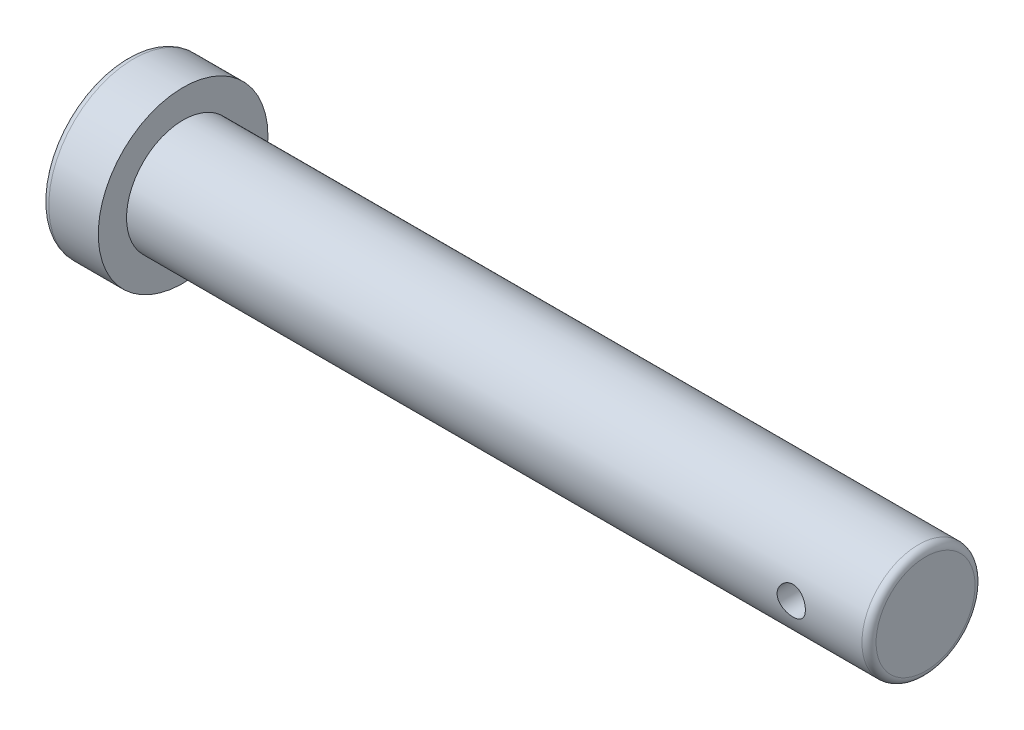
ISO-10303-21;
HEADER;
FILE_DESCRIPTION(('STEP AP214'),'2;1');
FILE_NAME('part.step','',(''),(''),'','','');
FILE_SCHEMA(('AUTOMOTIVE_DESIGN { 1 0 10303 214 1 1 1 1 }'));
ENDSEC;
DATA;
#1=APPLICATION_CONTEXT('core data for automotive mechanical design processes');
#2=APPLICATION_PROTOCOL_DEFINITION('international standard','automotive_design',2000,#1);
#3=PRODUCT_CONTEXT('',#1,'mechanical');
#4=PRODUCT('Part','Part','',(#3));
#5=PRODUCT_RELATED_PRODUCT_CATEGORY('part','',(#4));
#6=PRODUCT_DEFINITION_FORMATION('','',#4);
#7=PRODUCT_DEFINITION_CONTEXT('part definition',#1,'design');
#8=PRODUCT_DEFINITION('design','',#6,#7);
#9=PRODUCT_DEFINITION_SHAPE('','',#8);
#10=(LENGTH_UNIT() NAMED_UNIT(*) SI_UNIT(.MILLI.,.METRE.));
#11=(NAMED_UNIT(*) PLANE_ANGLE_UNIT() SI_UNIT($,.RADIAN.));
#12=(NAMED_UNIT(*) SI_UNIT($,.STERADIAN.) SOLID_ANGLE_UNIT());
#13=UNCERTAINTY_MEASURE_WITH_UNIT(LENGTH_MEASURE(1.E-05),#10,'distance_accuracy_value','');
#14=(GEOMETRIC_REPRESENTATION_CONTEXT(3) GLOBAL_UNCERTAINTY_ASSIGNED_CONTEXT((#13)) GLOBAL_UNIT_ASSIGNED_CONTEXT((#10,
#11,#12)) REPRESENTATION_CONTEXT('',''));
#15=CARTESIAN_POINT('',(0.,0.,0.));
#16=DIRECTION('',(0.,0.,1.));
#17=DIRECTION('',(1.,0.,0.));
#18=AXIS2_PLACEMENT_3D('',#15,#16,#17);
#19=CARTESIAN_POINT('',(4.,0.,0.));
#20=DIRECTION('',(-1.,0.,0.));
#21=DIRECTION('',(0.,0.,1.));
#22=AXIS2_PLACEMENT_3D('',#19,#20,#21);
#23=CYLINDRICAL_SURFACE('',#22,12.);
#24=CARTESIAN_POINT('',(-3.,0.,0.));
#25=DIRECTION('',(1.,0.,0.));
#26=DIRECTION('',(0.,0.,-1.));
#27=AXIS2_PLACEMENT_3D('',#24,#25,#26);
#28=CIRCLE('',#27,12.);
#29=CARTESIAN_POINT('',(-3.,0.,-12.));
#30=VERTEX_POINT('',#29);
#31=EDGE_CURVE('E93',#30,#30,#28,.T.);
#32=ORIENTED_EDGE('',*,*,#31,.T.);
#33=EDGE_LOOP('',(#32));
#34=FACE_BOUND('',#33,.T.);
#35=CARTESIAN_POINT('',(4.,0.,0.));
#36=DIRECTION('',(1.,0.,0.));
#37=DIRECTION('',(0.,0.,-1.));
#38=AXIS2_PLACEMENT_3D('',#35,#36,#37);
#39=CIRCLE('',#38,12.);
#40=CARTESIAN_POINT('',(4.,0.,-12.));
#41=VERTEX_POINT('',#40);
#42=EDGE_CURVE('E97',#41,#41,#39,.T.);
#43=ORIENTED_EDGE('',*,*,#42,.F.);
#44=EDGE_LOOP('',(#43));
#45=FACE_BOUND('',#44,.T.);
#46=ADVANCED_FACE('F30',(#34,#45),#23,.T.);
#47=CARTESIAN_POINT('',(4.,0.,0.));
#48=DIRECTION('',(1.,0.,0.));
#49=DIRECTION('',(0.,0.,-1.));
#50=AXIS2_PLACEMENT_3D('',#47,#48,#49);
#51=PLANE('',#50);
#52=CARTESIAN_POINT('',(4.,0.,0.));
#53=DIRECTION('',(1.,0.,0.));
#54=DIRECTION('',(0.,0.,-1.));
#55=AXIS2_PLACEMENT_3D('',#52,#53,#54);
#56=CIRCLE('',#55,8.);
#57=CARTESIAN_POINT('',(4.,0.,-8.));
#58=VERTEX_POINT('',#57);
#59=EDGE_CURVE('E94',#58,#58,#56,.T.);
#60=ORIENTED_EDGE('',*,*,#59,.F.);
#61=EDGE_LOOP('',(#60));
#62=FACE_BOUND('',#61,.T.);
#63=ORIENTED_EDGE('',*,*,#42,.T.);
#64=EDGE_LOOP('',(#63));
#65=FACE_BOUND('',#64,.T.);
#66=ADVANCED_FACE('F77',(#62,#65),#51,.T.);
#67=CARTESIAN_POINT('',(-4.,0.,0.));
#68=DIRECTION('',(1.,0.,0.));
#69=DIRECTION('',(0.,0.,-1.));
#70=AXIS2_PLACEMENT_3D('',#67,#68,#69);
#71=PLANE('',#70);
#72=CARTESIAN_POINT('',(-4.,0.,0.));
#73=DIRECTION('',(1.,0.,0.));
#74=DIRECTION('',(0.,0.,-1.));
#75=AXIS2_PLACEMENT_3D('',#72,#73,#74);
#76=CIRCLE('',#75,11.);
#77=CARTESIAN_POINT('',(-4.,0.,-11.));
#78=VERTEX_POINT('',#77);
#79=EDGE_CURVE('E48',#78,#78,#76,.F.);
#80=ORIENTED_EDGE('',*,*,#79,.T.);
#81=EDGE_LOOP('',(#80));
#82=FACE_BOUND('',#81,.T.);
#83=ADVANCED_FACE('F74',(#82),#71,.F.);
#84=CARTESIAN_POINT('',(109.,0.,0.));
#85=DIRECTION('',(-1.,0.,0.));
#86=DIRECTION('',(0.,0.,1.));
#87=AXIS2_PLACEMENT_3D('',#84,#85,#86);
#88=CYLINDRICAL_SURFACE('',#87,8.);
#89=CARTESIAN_POINT('',(100.,0.,8.));
#90=CARTESIAN_POINT('',(99.9999968990158,-0.110501451559641,7.9999981315735));
#91=CARTESIAN_POINT('',(99.990811265635,-0.22103754377435,7.99768770842435));
#92=CARTESIAN_POINT('',(99.954366464924,-0.438941765027376,7.98869485106526));
#93=CARTESIAN_POINT('',(99.9270970539495,-0.546308062494318,7.98200993893301));
#94=CARTESIAN_POINT('',(99.8554143287172,-0.754694496243434,7.96500835109376));
#95=CARTESIAN_POINT('',(99.811021601713,-0.855722084573335,7.95469603789411));
#96=CARTESIAN_POINT('',(99.7064248132735,-1.04889617587257,7.93153791743495));
#97=CARTESIAN_POINT('',(99.646220218508,-1.14104237913168,7.91869202472208));
#98=CARTESIAN_POINT('',(99.5103989471278,-1.31573590306788,7.89156551455591));
#99=CARTESIAN_POINT('',(99.4345179000546,-1.39807425341474,7.87726276197502));
#100=CARTESIAN_POINT('',(99.270063726788,-1.54899856960442,7.84898160157249));
#101=CARTESIAN_POINT('',(99.1814891694041,-1.61758298259892,7.83500323053157));
#102=CARTESIAN_POINT('',(98.992539697684,-1.74003539039863,7.80873034264225));
#103=CARTESIAN_POINT('',(98.8920090255884,-1.79366962123352,7.79646392619748));
#104=CARTESIAN_POINT('',(98.6830021177866,-1.88319587806765,7.77532659757355));
#105=CARTESIAN_POINT('',(98.5745271555573,-1.91909074058685,7.76645514259225));
#106=CARTESIAN_POINT('',(98.3550086690644,-1.97140644907302,7.7533396892843));
#107=CARTESIAN_POINT('',(98.244060138616,-1.98820302444273,7.74900654662681));
#108=CARTESIAN_POINT('',(98.0208419080009,-2.00301570008854,7.74519149946122));
#109=CARTESIAN_POINT('',(97.9085724257438,-2.00103485575748,7.74570880570571));
#110=CARTESIAN_POINT('',(97.6887789230062,-1.9786486995196,7.75145607355756));
#111=CARTESIAN_POINT('',(97.5812058380462,-1.95869112025417,7.75657150676392));
#112=CARTESIAN_POINT('',(97.3709852654519,-1.90163224920398,7.77075612894759));
#113=CARTESIAN_POINT('',(97.2683381292948,-1.86452973609252,7.77982559958985));
#114=CARTESIAN_POINT('',(97.0696826449972,-1.77385263724958,7.80100151874212));
#115=CARTESIAN_POINT('',(96.9737517709472,-1.72011555631056,7.81313769959755));
#116=CARTESIAN_POINT('',(96.7921083869909,-1.59780836801993,7.83906281127988));
#117=CARTESIAN_POINT('',(96.7063976692437,-1.52923566507845,7.85285203112837));
#118=CARTESIAN_POINT('',(96.5450618457408,-1.37688456624162,7.88101174053189));
#119=CARTESIAN_POINT('',(96.4697940132515,-1.29272834422114,7.89538759304001));
#120=CARTESIAN_POINT('',(96.3343716767148,-1.11281589000493,7.92274620771675));
#121=CARTESIAN_POINT('',(96.2742176343152,-1.01705930361059,7.93572892732543));
#122=CARTESIAN_POINT('',(96.1705992183675,-0.816154518241855,7.95890309458921));
#123=CARTESIAN_POINT('',(96.1271928796608,-0.710975190944831,7.96908480170303));
#124=CARTESIAN_POINT('',(96.0587769257206,-0.494501344190513,7.98543889321888));
#125=CARTESIAN_POINT('',(96.0337637914425,-0.383207998867318,7.99161204452374));
#126=CARTESIAN_POINT('',(96.0033899125882,-0.160719960520042,7.999139990285));
#127=CARTESIAN_POINT('',(95.9975426318996,-0.049595626650952,8.00061404677705));
#128=CARTESIAN_POINT('',(96.0043320027407,0.172043833068673,7.99891739752601));
#129=CARTESIAN_POINT('',(96.0169669903989,0.282559012859456,7.99574710989128));
#130=CARTESIAN_POINT('',(96.0599612111885,0.498152358368652,7.98519441503143));
#131=CARTESIAN_POINT('',(96.0900550179693,0.603286825291669,7.97787512247748));
#132=CARTESIAN_POINT('',(96.1668094453713,0.807009723270011,7.95984942178845));
#133=CARTESIAN_POINT('',(96.2134717390842,0.905597492043508,7.94914267159856));
#134=CARTESIAN_POINT('',(96.3229815051663,1.09536417923979,7.92524410568414));
#135=CARTESIAN_POINT('',(96.3861014831957,1.18638058911443,7.91201156489243));
#136=CARTESIAN_POINT('',(96.5263865450626,1.35670215152432,7.88459345583226));
#137=CARTESIAN_POINT('',(96.6035540528225,1.43600527863067,7.87040772335606));
#138=CARTESIAN_POINT('',(96.7720026144593,1.58265409076364,7.84225275947695));
#139=CARTESIAN_POINT('',(96.8635836040032,1.6496584901627,7.82829738916375));
#140=CARTESIAN_POINT('',(97.0569768459543,1.76734767868359,7.80257171169652));
#141=CARTESIAN_POINT('',(97.1587886439463,1.81803319221058,7.79080130756035));
#142=CARTESIAN_POINT('',(97.3692076298841,1.90126856081239,7.77090792979553));
#143=CARTESIAN_POINT('',(97.4777701711253,1.93392586220541,7.76276340389208));
#144=CARTESIAN_POINT('',(97.6990795171855,1.98046087993836,7.75102325453578));
#145=CARTESIAN_POINT('',(97.8118254013767,1.99434270330487,7.74742663626582));
#146=CARTESIAN_POINT('',(98.0348280318069,2.00271812044532,7.74526534938609));
#147=CARTESIAN_POINT('',(98.145063246833,1.99775719704016,7.74655910304351));
#148=CARTESIAN_POINT('',(98.3630718515573,1.96983637108382,7.7537054534379));
#149=CARTESIAN_POINT('',(98.4708452906848,1.94687683024902,7.75955795855809));
#150=CARTESIAN_POINT('',(98.6802779454205,1.88390842592372,7.77508347576963));
#151=CARTESIAN_POINT('',(98.7819697403203,1.84400187290717,7.78473353648413));
#152=CARTESIAN_POINT('',(98.9772871769516,1.74835321814009,7.80677007633105));
#153=CARTESIAN_POINT('',(99.0709116975826,1.69260892004559,7.81915693494364));
#154=CARTESIAN_POINT('',(99.2500728386694,1.56515699818285,7.84567512351349));
#155=CARTESIAN_POINT('',(99.3353347645653,1.49307088388301,7.85984353109009));
#156=CARTESIAN_POINT('',(99.4927293930605,1.33571916158631,7.88810702995048));
#157=CARTESIAN_POINT('',(99.564858973484,1.25045042834819,7.90220210302746));
#158=CARTESIAN_POINT('',(99.6952150780862,1.06729011560345,7.92903540863551));
#159=CARTESIAN_POINT('',(99.7531661515621,0.969197896421844,7.94174444487824));
#160=CARTESIAN_POINT('',(99.8516632839207,0.764354746013966,7.96406566633491));
#161=CARTESIAN_POINT('',(99.8922218141981,0.657610084582318,7.97368006933042));
#162=CARTESIAN_POINT('',(99.9487624404395,0.459213670991294,7.98730746087389));
#163=CARTESIAN_POINT('',(99.9679349907379,0.36850689454409,7.9920344673692));
#164=CARTESIAN_POINT('',(99.9935545914959,0.18520809538171,7.99838140309264));
#165=CARTESIAN_POINT('',(100.000002599074,0.0926162149901548,8.00000156601192));
#166=CARTESIAN_POINT('',(100.,0.,8.));
#167=B_SPLINE_CURVE_WITH_KNOTS('',3,(#89,#90,#91,#92,#93,#94,#95,#96,#97,#98,#99,#100,#101,#102,
#103,#104,#105,#106,#107,#108,#109,#110,#111,#112,#113,#114,#115,#116,#117,#118,#119,#120,#121,
#122,#123,#124,#125,#126,#127,#128,#129,#130,#131,#132,#133,#134,#135,#136,#137,#138,#139,#140,
#141,#142,#143,#144,#145,#146,#147,#148,#149,#150,#151,#152,#153,#154,#155,#156,#157,#158,#159,
#160,#161,#162,#163,#164,#165,#166),.UNSPECIFIED.,.T.,.F.,(4,2,2,2,2,2,2,2,2,2,2,2,2,2,2,2,2,2,
2,2,2,2,2,2,2,2,2,2,2,2,2,2,2,2,2,2,2,2,4),(0.,0.331164949962519,0.662517650351865,
0.993473203048145,1.32443992022576,1.66152580582852,1.99864972773415,2.34078196727743,
2.68285948225823,3.01808393468094,3.3532538415469,3.68029996013785,4.00736937959145,
4.33774037169599,4.66816921119311,5.00802001296453,5.34788119415423,5.68890972016578,
6.0298729825595,6.36211078603461,6.6943186815475,7.02160366023142,7.3489216976748,
7.68204783424895,8.01523150681784,8.35659345610394,8.69794025003769,9.03723006156474,
9.37644564340969,9.70591707202575,10.035381879458,10.3628853408369,10.6904342418696,
11.0265276855097,11.3627009303165,11.7049624733721,12.0469781843289,12.3245632392729,
12.6021274139514),.UNSPECIFIED.);
#168=CARTESIAN_POINT('',(100.,0.,8.));
#169=VERTEX_POINT('',#168);
#170=EDGE_CURVE('E34',#169,#169,#167,.T.);
#171=ORIENTED_EDGE('',*,*,#170,.T.);
#172=EDGE_LOOP('',(#171));
#173=FACE_BOUND('',#172,.T.);
#174=CARTESIAN_POINT('',(100.,0.,-8.));
#175=CARTESIAN_POINT('',(99.9999968990158,0.110501451559641,-7.9999981315735));
#176=CARTESIAN_POINT('',(99.990811265635,0.22103754377435,-7.99768770842435));
#177=CARTESIAN_POINT('',(99.954366464924,0.438941765027376,-7.98869485106526));
#178=CARTESIAN_POINT('',(99.9270970539495,0.546308062494318,-7.98200993893301));
#179=CARTESIAN_POINT('',(99.8554143287172,0.754694496243434,-7.96500835109376));
#180=CARTESIAN_POINT('',(99.811021601713,0.855722084573335,-7.95469603789411));
#181=CARTESIAN_POINT('',(99.7064248132735,1.04889617587257,-7.93153791743495));
#182=CARTESIAN_POINT('',(99.646220218508,1.14104237913168,-7.91869202472208));
#183=CARTESIAN_POINT('',(99.5103989471278,1.31573590306788,-7.89156551455591));
#184=CARTESIAN_POINT('',(99.4345179000546,1.39807425341474,-7.87726276197502));
#185=CARTESIAN_POINT('',(99.270063726788,1.54899856960442,-7.84898160157249));
#186=CARTESIAN_POINT('',(99.1814891694041,1.61758298259892,-7.83500323053157));
#187=CARTESIAN_POINT('',(98.992539697684,1.74003539039863,-7.80873034264225));
#188=CARTESIAN_POINT('',(98.8920090255884,1.79366962123352,-7.79646392619748));
#189=CARTESIAN_POINT('',(98.6830021177866,1.88319587806765,-7.77532659757355));
#190=CARTESIAN_POINT('',(98.5745271555573,1.91909074058685,-7.76645514259225));
#191=CARTESIAN_POINT('',(98.3550086690644,1.97140644907302,-7.7533396892843));
#192=CARTESIAN_POINT('',(98.244060138616,1.98820302444273,-7.74900654662681));
#193=CARTESIAN_POINT('',(98.0208419080009,2.00301570008854,-7.74519149946122));
#194=CARTESIAN_POINT('',(97.9085724257438,2.00103485575748,-7.74570880570571));
#195=CARTESIAN_POINT('',(97.6887789230062,1.9786486995196,-7.75145607355756));
#196=CARTESIAN_POINT('',(97.5812058380462,1.95869112025417,-7.75657150676392));
#197=CARTESIAN_POINT('',(97.3709852654519,1.90163224920398,-7.77075612894759));
#198=CARTESIAN_POINT('',(97.2683381292948,1.86452973609252,-7.77982559958985));
#199=CARTESIAN_POINT('',(97.0696826449972,1.77385263724958,-7.80100151874212));
#200=CARTESIAN_POINT('',(96.9737517709472,1.72011555631056,-7.81313769959755));
#201=CARTESIAN_POINT('',(96.7921083869909,1.59780836801993,-7.83906281127988));
#202=CARTESIAN_POINT('',(96.7063976692437,1.52923566507845,-7.85285203112837));
#203=CARTESIAN_POINT('',(96.5450618457408,1.37688456624162,-7.88101174053189));
#204=CARTESIAN_POINT('',(96.4697940132515,1.29272834422114,-7.89538759304001));
#205=CARTESIAN_POINT('',(96.3343716767148,1.11281589000493,-7.92274620771675));
#206=CARTESIAN_POINT('',(96.2742176343152,1.01705930361059,-7.93572892732543));
#207=CARTESIAN_POINT('',(96.1705992183675,0.816154518241855,-7.95890309458921));
#208=CARTESIAN_POINT('',(96.1271928796608,0.710975190944831,-7.96908480170303));
#209=CARTESIAN_POINT('',(96.0587769257206,0.494501344190513,-7.98543889321888));
#210=CARTESIAN_POINT('',(96.0337637914425,0.383207998867318,-7.99161204452374));
#211=CARTESIAN_POINT('',(96.0033899125882,0.160719960520042,-7.999139990285));
#212=CARTESIAN_POINT('',(95.9975426318996,0.049595626650952,-8.00061404677705));
#213=CARTESIAN_POINT('',(96.0043320027407,-0.172043833068673,-7.99891739752601));
#214=CARTESIAN_POINT('',(96.0169669903989,-0.282559012859456,-7.99574710989128));
#215=CARTESIAN_POINT('',(96.0599612111885,-0.498152358368652,-7.98519441503143));
#216=CARTESIAN_POINT('',(96.0900550179693,-0.603286825291669,-7.97787512247748));
#217=CARTESIAN_POINT('',(96.1668094453713,-0.807009723270011,-7.95984942178845));
#218=CARTESIAN_POINT('',(96.2134717390842,-0.905597492043508,-7.94914267159856));
#219=CARTESIAN_POINT('',(96.3229815051663,-1.09536417923979,-7.92524410568414));
#220=CARTESIAN_POINT('',(96.3861014831957,-1.18638058911443,-7.91201156489243));
#221=CARTESIAN_POINT('',(96.5263865450626,-1.35670215152432,-7.88459345583226));
#222=CARTESIAN_POINT('',(96.6035540528225,-1.43600527863067,-7.87040772335606));
#223=CARTESIAN_POINT('',(96.7720026144593,-1.58265409076364,-7.84225275947695));
#224=CARTESIAN_POINT('',(96.8635836040032,-1.6496584901627,-7.82829738916375));
#225=CARTESIAN_POINT('',(97.0569768459543,-1.76734767868359,-7.80257171169652));
#226=CARTESIAN_POINT('',(97.1587886439463,-1.81803319221058,-7.79080130756035));
#227=CARTESIAN_POINT('',(97.3692076298841,-1.90126856081239,-7.77090792979553));
#228=CARTESIAN_POINT('',(97.4777701711253,-1.93392586220541,-7.76276340389208));
#229=CARTESIAN_POINT('',(97.6990795171855,-1.98046087993836,-7.75102325453578));
#230=CARTESIAN_POINT('',(97.8118254013767,-1.99434270330487,-7.74742663626582));
#231=CARTESIAN_POINT('',(98.0348280318069,-2.00271812044532,-7.74526534938609));
#232=CARTESIAN_POINT('',(98.145063246833,-1.99775719704016,-7.74655910304351));
#233=CARTESIAN_POINT('',(98.3630718515573,-1.96983637108382,-7.7537054534379));
#234=CARTESIAN_POINT('',(98.4708452906848,-1.94687683024902,-7.75955795855809));
#235=CARTESIAN_POINT('',(98.6802779454205,-1.88390842592372,-7.77508347576963));
#236=CARTESIAN_POINT('',(98.7819697403203,-1.84400187290717,-7.78473353648413));
#237=CARTESIAN_POINT('',(98.9772871769516,-1.74835321814009,-7.80677007633105));
#238=CARTESIAN_POINT('',(99.0709116975826,-1.69260892004559,-7.81915693494364));
#239=CARTESIAN_POINT('',(99.2500728386694,-1.56515699818285,-7.84567512351349));
#240=CARTESIAN_POINT('',(99.3353347645653,-1.49307088388301,-7.85984353109009));
#241=CARTESIAN_POINT('',(99.4927293930605,-1.33571916158631,-7.88810702995048));
#242=CARTESIAN_POINT('',(99.564858973484,-1.25045042834819,-7.90220210302746));
#243=CARTESIAN_POINT('',(99.6952150780862,-1.06729011560345,-7.92903540863551));
#244=CARTESIAN_POINT('',(99.7531661515621,-0.969197896421844,-7.94174444487824));
#245=CARTESIAN_POINT('',(99.8516632839207,-0.764354746013966,-7.96406566633491));
#246=CARTESIAN_POINT('',(99.8922218141981,-0.657610084582318,-7.97368006933042));
#247=CARTESIAN_POINT('',(99.9487624404395,-0.459213670991294,-7.98730746087389));
#248=CARTESIAN_POINT('',(99.9679349907379,-0.36850689454409,-7.9920344673692));
#249=CARTESIAN_POINT('',(99.9935545914959,-0.18520809538171,-7.99838140309264));
#250=CARTESIAN_POINT('',(100.000002599074,-0.0926162149901548,-8.00000156601192));
#251=CARTESIAN_POINT('',(100.,0.,-8.));
#252=B_SPLINE_CURVE_WITH_KNOTS('',3,(#174,#175,#176,#177,#178,#179,#180,#181,#182,#183,#184,
#185,#186,#187,#188,#189,#190,#191,#192,#193,#194,#195,#196,#197,#198,#199,#200,#201,#202,#203,
#204,#205,#206,#207,#208,#209,#210,#211,#212,#213,#214,#215,#216,#217,#218,#219,#220,#221,#222,
#223,#224,#225,#226,#227,#228,#229,#230,#231,#232,#233,#234,#235,#236,#237,#238,#239,#240,#241,
#242,#243,#244,#245,#246,#247,#248,#249,#250,#251),.UNSPECIFIED.,.T.,.F.,(4,2,2,2,2,2,2,2,2,2,2,
2,2,2,2,2,2,2,2,2,2,2,2,2,2,2,2,2,2,2,2,2,2,2,2,2,2,2,4),(0.,0.331164949962519,
0.662517650351865,0.993473203048145,1.32443992022576,1.66152580582852,1.99864972773415,
2.34078196727743,2.68285948225823,3.01808393468094,3.3532538415469,3.68029996013785,
4.00736937959145,4.33774037169599,4.66816921119311,5.00802001296453,5.34788119415423,
5.68890972016578,6.0298729825595,6.36211078603461,6.6943186815475,7.02160366023142,
7.3489216976748,7.68204783424895,8.01523150681784,8.35659345610394,8.69794025003769,
9.03723006156474,9.37644564340969,9.70591707202575,10.035381879458,10.3628853408369,
10.6904342418696,11.0265276855097,11.3627009303165,11.7049624733721,12.0469781843289,
12.3245632392729,12.6021274139514),.UNSPECIFIED.);
#253=CARTESIAN_POINT('',(100.,0.,-8.));
#254=VERTEX_POINT('',#253);
#255=EDGE_CURVE('E51',#254,#254,#252,.T.);
#256=ORIENTED_EDGE('',*,*,#255,.T.);
#257=EDGE_LOOP('',(#256));
#258=FACE_BOUND('',#257,.T.);
#259=CARTESIAN_POINT('',(108.,0.,0.));
#260=DIRECTION('',(1.,0.,0.));
#261=DIRECTION('',(0.,0.,-1.));
#262=AXIS2_PLACEMENT_3D('',#259,#260,#261);
#263=CIRCLE('',#262,8.);
#264=CARTESIAN_POINT('',(108.,0.,-8.));
#265=VERTEX_POINT('',#264);
#266=EDGE_CURVE('E10',#265,#265,#263,.F.);
#267=ORIENTED_EDGE('',*,*,#266,.T.);
#268=EDGE_LOOP('',(#267));
#269=FACE_BOUND('',#268,.T.);
#270=ORIENTED_EDGE('',*,*,#59,.T.);
#271=EDGE_LOOP('',(#270));
#272=FACE_BOUND('',#271,.T.);
#273=ADVANCED_FACE('F56',(#173,#258,#269,#272),#88,.T.);
#274=CARTESIAN_POINT('',(109.,0.,0.));
#275=DIRECTION('',(1.,0.,0.));
#276=DIRECTION('',(0.,0.,-1.));
#277=AXIS2_PLACEMENT_3D('',#274,#275,#276);
#278=PLANE('',#277);
#279=CARTESIAN_POINT('',(109.,0.,0.));
#280=DIRECTION('',(1.,0.,0.));
#281=DIRECTION('',(0.,0.,-1.));
#282=AXIS2_PLACEMENT_3D('',#279,#280,#281);
#283=CIRCLE('',#282,7.);
#284=CARTESIAN_POINT('',(109.,0.,-7.));
#285=VERTEX_POINT('',#284);
#286=EDGE_CURVE('E43',#285,#285,#283,.T.);
#287=ORIENTED_EDGE('',*,*,#286,.T.);
#288=EDGE_LOOP('',(#287));
#289=FACE_BOUND('',#288,.T.);
#290=ADVANCED_FACE('F64',(#289),#278,.T.);
#291=CARTESIAN_POINT('',(-3.,0.,0.));
#292=DIRECTION('',(1.,0.,0.));
#293=DIRECTION('',(0.,0.,-1.));
#294=AXIS2_PLACEMENT_3D('',#291,#292,#293);
#295=TOROIDAL_SURFACE('',#294,11.,1.);
#296=ORIENTED_EDGE('',*,*,#79,.F.);
#297=EDGE_LOOP('',(#296));
#298=FACE_BOUND('',#297,.T.);
#299=ORIENTED_EDGE('',*,*,#31,.F.);
#300=EDGE_LOOP('',(#299));
#301=FACE_BOUND('',#300,.T.);
#302=ADVANCED_FACE('F67',(#298,#301),#295,.T.);
#303=CARTESIAN_POINT('',(108.,0.,0.));
#304=DIRECTION('',(1.,0.,0.));
#305=DIRECTION('',(0.,0.,-1.));
#306=AXIS2_PLACEMENT_3D('',#303,#304,#305);
#307=TOROIDAL_SURFACE('',#306,7.,1.);
#308=ORIENTED_EDGE('',*,*,#266,.F.);
#309=EDGE_LOOP('',(#308));
#310=FACE_BOUND('',#309,.T.);
#311=ORIENTED_EDGE('',*,*,#286,.F.);
#312=EDGE_LOOP('',(#311));
#313=FACE_BOUND('',#312,.T.);
#314=ADVANCED_FACE('F32',(#310,#313),#307,.T.);
#315=CARTESIAN_POINT('',(98.,0.,-10.));
#316=DIRECTION('',(0.,0.,1.));
#317=DIRECTION('',(1.,0.,0.));
#318=AXIS2_PLACEMENT_3D('',#315,#316,#317);
#319=CYLINDRICAL_SURFACE('',#318,2.);
#320=ORIENTED_EDGE('',*,*,#255,.F.);
#321=EDGE_LOOP('',(#320));
#322=FACE_BOUND('',#321,.T.);
#323=ORIENTED_EDGE('',*,*,#170,.F.);
#324=EDGE_LOOP('',(#323));
#325=FACE_BOUND('',#324,.T.);
#326=ADVANCED_FACE('F60',(#322,#325),#319,.F.);
#327=CLOSED_SHELL('',(#46,#66,#83,#273,#290,#302,#314,#326));
#328=MANIFOLD_SOLID_BREP('B2',#327);
#329=ADVANCED_BREP_SHAPE_REPRESENTATION('',(#18,#328),#14);
#330=SHAPE_DEFINITION_REPRESENTATION(#9,#329);
ENDSEC;
END-ISO-10303-21;
